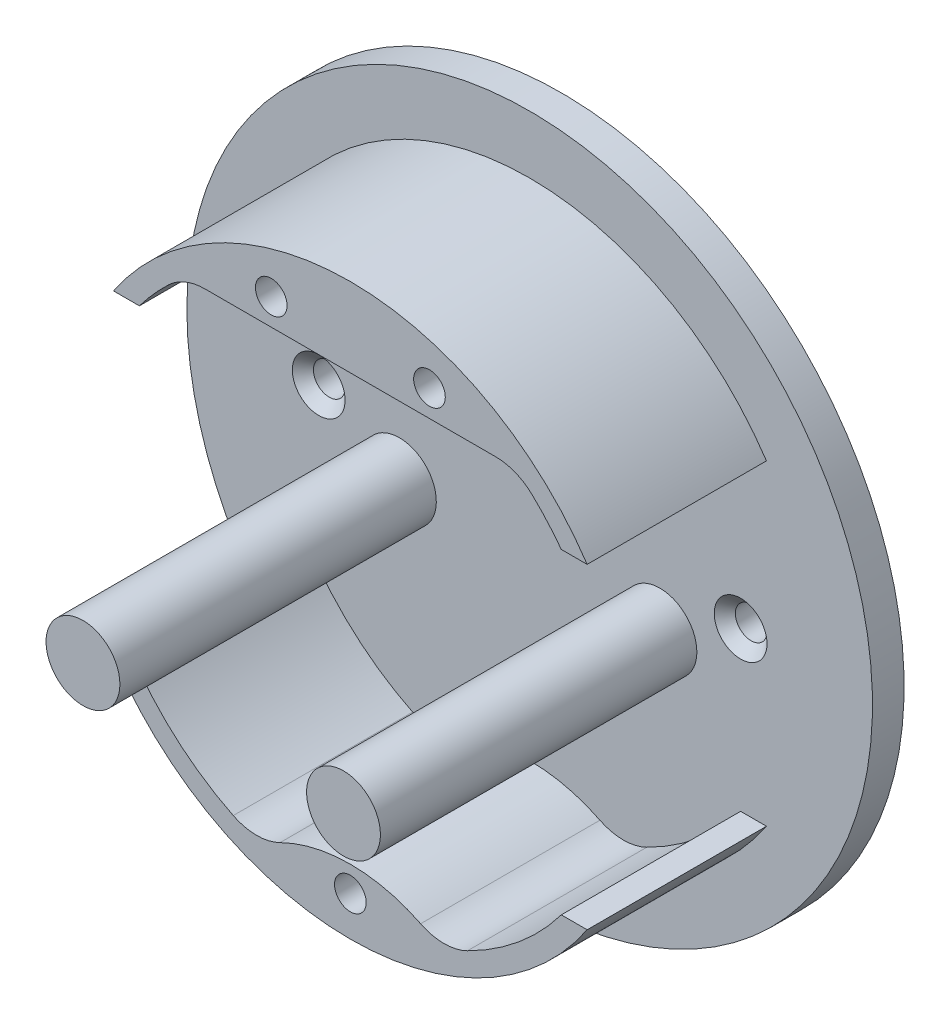
ISO-10303-21;
HEADER;
FILE_DESCRIPTION(('STEP AP214'),'2;1');
FILE_NAME('part.step','',(''),(''),'','','');
FILE_SCHEMA(('AUTOMOTIVE_DESIGN { 1 0 10303 214 1 1 1 1 }'));
ENDSEC;
DATA;
#1=APPLICATION_CONTEXT('core data for automotive mechanical design processes');
#2=APPLICATION_PROTOCOL_DEFINITION('international standard','automotive_design',2000,#1);
#3=PRODUCT_CONTEXT('',#1,'mechanical');
#4=PRODUCT('Part','Part','',(#3));
#5=PRODUCT_RELATED_PRODUCT_CATEGORY('part','',(#4));
#6=PRODUCT_DEFINITION_FORMATION('','',#4);
#7=PRODUCT_DEFINITION_CONTEXT('part definition',#1,'design');
#8=PRODUCT_DEFINITION('design','',#6,#7);
#9=PRODUCT_DEFINITION_SHAPE('','',#8);
#10=(LENGTH_UNIT() NAMED_UNIT(*) SI_UNIT(.MILLI.,.METRE.));
#11=(NAMED_UNIT(*) PLANE_ANGLE_UNIT() SI_UNIT($,.RADIAN.));
#12=(NAMED_UNIT(*) SI_UNIT($,.STERADIAN.) SOLID_ANGLE_UNIT());
#13=UNCERTAINTY_MEASURE_WITH_UNIT(LENGTH_MEASURE(1.E-05),#10,'distance_accuracy_value','');
#14=(GEOMETRIC_REPRESENTATION_CONTEXT(3) GLOBAL_UNCERTAINTY_ASSIGNED_CONTEXT((#13)) GLOBAL_UNIT_ASSIGNED_CONTEXT((#10,
#11,#12)) REPRESENTATION_CONTEXT('',''));
#15=CARTESIAN_POINT('',(0.,0.,0.));
#16=DIRECTION('',(0.,0.,1.));
#17=DIRECTION('',(1.,0.,0.));
#18=AXIS2_PLACEMENT_3D('',#15,#16,#17);
#19=CARTESIAN_POINT('',(0.,0.,20.));
#20=DIRECTION('',(0.,0.,-1.));
#21=DIRECTION('',(-1.,0.,0.));
#22=AXIS2_PLACEMENT_3D('',#19,#20,#21);
#23=CYLINDRICAL_SURFACE('',#22,25.);
#24=DIRECTION('',(0.,0.,-1.));
#25=VECTOR('',#24,1.);
#26=CARTESIAN_POINT('',(-20.,15.,20.));
#27=LINE('',#26,#25);
#28=CARTESIAN_POINT('',(-20.,15.,3.));
#29=VERTEX_POINT('',#28);
#30=CARTESIAN_POINT('',(-20.,15.,20.));
#31=VERTEX_POINT('',#30);
#32=EDGE_CURVE('E164',#29,#31,#27,.F.);
#33=ORIENTED_EDGE('',*,*,#32,.F.);
#34=CARTESIAN_POINT('',(0.,0.,3.));
#35=DIRECTION('',(0.,0.,-1.));
#36=DIRECTION('',(-1.,0.,0.));
#37=AXIS2_PLACEMENT_3D('',#34,#35,#36);
#38=CIRCLE('',#37,25.);
#39=CARTESIAN_POINT('',(-17.2187216424449,18.125,3.));
#40=VERTEX_POINT('',#39);
#41=EDGE_CURVE('E162',#29,#40,#38,.T.);
#42=ORIENTED_EDGE('',*,*,#41,.T.);
#43=DIRECTION('',(0.,0.,-1.));
#44=VECTOR('',#43,1.);
#45=CARTESIAN_POINT('',(-17.2187216424449,18.125,20.));
#46=LINE('',#45,#44);
#47=CARTESIAN_POINT('',(-17.2187216424449,18.125,20.));
#48=VERTEX_POINT('',#47);
#49=EDGE_CURVE('E147',#40,#48,#46,.F.);
#50=ORIENTED_EDGE('',*,*,#49,.T.);
#51=CARTESIAN_POINT('',(0.,0.,20.));
#52=DIRECTION('',(0.,0.,1.));
#53=DIRECTION('',(1.,0.,0.));
#54=AXIS2_PLACEMENT_3D('',#51,#52,#53);
#55=CIRCLE('',#54,25.);
#56=EDGE_CURVE('E294',#48,#31,#55,.T.);
#57=ORIENTED_EDGE('',*,*,#56,.T.);
#58=EDGE_LOOP('',(#33,#42,#50,#57));
#59=FACE_BOUND('',#58,.T.);
#60=ADVANCED_FACE('F33',(#59),#23,.F.);
#61=DIRECTION('',(0.,0.,-1.));
#62=VECTOR('',#61,1.);
#63=CARTESIAN_POINT('',(-11.1026593463273,-22.3993516745332,20.));
#64=LINE('',#63,#62);
#65=CARTESIAN_POINT('',(-11.1026593463273,-22.3993516745332,20.));
#66=VERTEX_POINT('',#65);
#67=CARTESIAN_POINT('',(-11.1026593463273,-22.3993516745332,3.));
#68=VERTEX_POINT('',#67);
#69=EDGE_CURVE('E157',#66,#68,#64,.T.);
#70=ORIENTED_EDGE('',*,*,#69,.T.);
#71=CARTESIAN_POINT('',(-20.,-15.,3.));
#72=VERTEX_POINT('',#71);
#73=EDGE_CURVE('E169',#68,#72,#38,.T.);
#74=ORIENTED_EDGE('',*,*,#73,.T.);
#75=DIRECTION('',(0.,0.,-1.));
#76=VECTOR('',#75,1.);
#77=CARTESIAN_POINT('',(-20.,-15.,20.));
#78=LINE('',#77,#76);
#79=CARTESIAN_POINT('',(-20.,-15.,20.));
#80=VERTEX_POINT('',#79);
#81=EDGE_CURVE('E305',#80,#72,#78,.T.);
#82=ORIENTED_EDGE('',*,*,#81,.F.);
#83=EDGE_CURVE('E295',#80,#66,#55,.T.);
#84=ORIENTED_EDGE('',*,*,#83,.T.);
#85=EDGE_LOOP('',(#70,#74,#82,#84));
#86=FACE_BOUND('',#85,.T.);
#87=ADVANCED_FACE('F381',(#86),#23,.F.);
#88=DIRECTION('',(0.,0.,-1.));
#89=VECTOR('',#88,1.);
#90=CARTESIAN_POINT('',(17.2187216424449,18.125,20.));
#91=LINE('',#90,#89);
#92=CARTESIAN_POINT('',(17.2187216424449,18.125,20.));
#93=VERTEX_POINT('',#92);
#94=CARTESIAN_POINT('',(17.2187216424449,18.125,3.));
#95=VERTEX_POINT('',#94);
#96=EDGE_CURVE('E313',#93,#95,#91,.T.);
#97=ORIENTED_EDGE('',*,*,#96,.T.);
#98=CARTESIAN_POINT('',(0.,0.,3.));
#99=DIRECTION('',(0.,0.,-1.));
#100=DIRECTION('',(-1.,0.,0.));
#101=AXIS2_PLACEMENT_3D('',#98,#99,#100);
#102=CIRCLE('',#101,25.);
#103=CARTESIAN_POINT('',(20.,15.,3.));
#104=VERTEX_POINT('',#103);
#105=EDGE_CURVE('E231',#95,#104,#102,.T.);
#106=ORIENTED_EDGE('',*,*,#105,.T.);
#107=DIRECTION('',(0.,0.,-1.));
#108=VECTOR('',#107,1.);
#109=CARTESIAN_POINT('',(20.,15.,20.));
#110=LINE('',#109,#108);
#111=CARTESIAN_POINT('',(20.,15.,20.));
#112=VERTEX_POINT('',#111);
#113=EDGE_CURVE('E302',#112,#104,#110,.T.);
#114=ORIENTED_EDGE('',*,*,#113,.F.);
#115=EDGE_CURVE('E290',#112,#93,#55,.T.);
#116=ORIENTED_EDGE('',*,*,#115,.T.);
#117=EDGE_LOOP('',(#97,#106,#114,#116));
#118=FACE_BOUND('',#117,.T.);
#119=ADVANCED_FACE('F338',(#118),#23,.F.);
#120=DIRECTION('',(0.,0.,-1.));
#121=VECTOR('',#120,1.);
#122=CARTESIAN_POINT('',(20.,-15.,20.));
#123=LINE('',#122,#121);
#124=CARTESIAN_POINT('',(20.,-15.,3.));
#125=VERTEX_POINT('',#124);
#126=CARTESIAN_POINT('',(20.,-15.,20.));
#127=VERTEX_POINT('',#126);
#128=EDGE_CURVE('E299',#125,#127,#123,.F.);
#129=ORIENTED_EDGE('',*,*,#128,.F.);
#130=CARTESIAN_POINT('',(11.1026593463273,-22.3993516745332,3.));
#131=VERTEX_POINT('',#130);
#132=EDGE_CURVE('E56',#125,#131,#102,.T.);
#133=ORIENTED_EDGE('',*,*,#132,.T.);
#134=DIRECTION('',(0.,0.,-1.));
#135=VECTOR('',#134,1.);
#136=CARTESIAN_POINT('',(11.1026593463273,-22.3993516745332,20.));
#137=LINE('',#136,#135);
#138=CARTESIAN_POINT('',(11.1026593463273,-22.3993516745332,20.));
#139=VERTEX_POINT('',#138);
#140=EDGE_CURVE('E158',#131,#139,#137,.F.);
#141=ORIENTED_EDGE('',*,*,#140,.T.);
#142=EDGE_CURVE('E289',#139,#127,#55,.T.);
#143=ORIENTED_EDGE('',*,*,#142,.T.);
#144=EDGE_LOOP('',(#129,#133,#141,#143));
#145=FACE_BOUND('',#144,.T.);
#146=ADVANCED_FACE('F354',(#145),#23,.F.);
#147=CARTESIAN_POINT('',(0.,0.,20.));
#148=DIRECTION('',(0.,0.,-1.));
#149=DIRECTION('',(-1.,0.,0.));
#150=AXIS2_PLACEMENT_3D('',#147,#148,#149);
#151=CYLINDRICAL_SURFACE('',#150,27.);
#152=CARTESIAN_POINT('',(0.,0.,3.));
#153=DIRECTION('',(0.,0.,-1.));
#154=DIRECTION('',(-1.,0.,0.));
#155=AXIS2_PLACEMENT_3D('',#152,#153,#154);
#156=CIRCLE('',#155,27.);
#157=CARTESIAN_POINT('',(-22.4499443206436,15.,3.));
#158=VERTEX_POINT('',#157);
#159=CARTESIAN_POINT('',(22.4499443206436,15.,3.));
#160=VERTEX_POINT('',#159);
#161=EDGE_CURVE('E228',#158,#160,#156,.T.);
#162=ORIENTED_EDGE('',*,*,#161,.F.);
#163=DIRECTION('',(0.,0.,-1.));
#164=VECTOR('',#163,1.);
#165=CARTESIAN_POINT('',(-22.4499443206436,15.,20.));
#166=LINE('',#165,#164);
#167=CARTESIAN_POINT('',(-22.4499443206436,15.,20.));
#168=VERTEX_POINT('',#167);
#169=EDGE_CURVE('E282',#158,#168,#166,.F.);
#170=ORIENTED_EDGE('',*,*,#169,.T.);
#171=CARTESIAN_POINT('',(0.,0.,20.));
#172=DIRECTION('',(0.,0.,1.));
#173=DIRECTION('',(1.,0.,0.));
#174=AXIS2_PLACEMENT_3D('',#171,#172,#173);
#175=CIRCLE('',#174,27.);
#176=CARTESIAN_POINT('',(22.4499443206436,15.,20.));
#177=VERTEX_POINT('',#176);
#178=EDGE_CURVE('E298',#177,#168,#175,.T.);
#179=ORIENTED_EDGE('',*,*,#178,.F.);
#180=DIRECTION('',(0.,0.,-1.));
#181=VECTOR('',#180,1.);
#182=CARTESIAN_POINT('',(22.4499443206436,15.,20.));
#183=LINE('',#182,#181);
#184=EDGE_CURVE('E286',#177,#160,#183,.T.);
#185=ORIENTED_EDGE('',*,*,#184,.T.);
#186=EDGE_LOOP('',(#162,#170,#179,#185));
#187=FACE_BOUND('',#186,.T.);
#188=ADVANCED_FACE('F348',(#187),#151,.T.);
#189=CARTESIAN_POINT('',(22.4499443206436,-15.,3.));
#190=VERTEX_POINT('',#189);
#191=CARTESIAN_POINT('',(-22.4499443206436,-15.,3.));
#192=VERTEX_POINT('',#191);
#193=EDGE_CURVE('E227',#190,#192,#156,.T.);
#194=ORIENTED_EDGE('',*,*,#193,.F.);
#195=DIRECTION('',(0.,0.,-1.));
#196=VECTOR('',#195,1.);
#197=CARTESIAN_POINT('',(22.4499443206436,-15.,20.));
#198=LINE('',#197,#196);
#199=CARTESIAN_POINT('',(22.4499443206436,-15.,20.));
#200=VERTEX_POINT('',#199);
#201=EDGE_CURVE('E273',#190,#200,#198,.F.);
#202=ORIENTED_EDGE('',*,*,#201,.T.);
#203=CARTESIAN_POINT('',(-22.4499443206436,-15.,20.));
#204=VERTEX_POINT('',#203);
#205=EDGE_CURVE('E293',#204,#200,#175,.T.);
#206=ORIENTED_EDGE('',*,*,#205,.F.);
#207=DIRECTION('',(0.,0.,-1.));
#208=VECTOR('',#207,1.);
#209=CARTESIAN_POINT('',(-22.4499443206436,-15.,20.));
#210=LINE('',#209,#208);
#211=EDGE_CURVE('E277',#204,#192,#210,.T.);
#212=ORIENTED_EDGE('',*,*,#211,.T.);
#213=EDGE_LOOP('',(#194,#202,#206,#212));
#214=FACE_BOUND('',#213,.T.);
#215=ADVANCED_FACE('F366',(#214),#151,.T.);
#216=CARTESIAN_POINT('',(-15.644487847162,19.5,20.));
#217=DIRECTION('',(0.,1.,0.));
#218=DIRECTION('',(0.,0.,1.));
#219=AXIS2_PLACEMENT_3D('',#216,#217,#218);
#220=PLANE('',#219);
#221=DIRECTION('',(-1.,0.,0.));
#222=VECTOR('',#221,1.);
#223=CARTESIAN_POINT('',(-15.644487847162,19.5,3.));
#224=LINE('',#223,#222);
#225=CARTESIAN_POINT('',(13.7749773139559,19.5,3.));
#226=VERTEX_POINT('',#225);
#227=CARTESIAN_POINT('',(-13.7749773139559,19.5,3.));
#228=VERTEX_POINT('',#227);
#229=EDGE_CURVE('E167',#226,#228,#224,.T.);
#230=ORIENTED_EDGE('',*,*,#229,.F.);
#231=DIRECTION('',(0.,0.,-1.));
#232=VECTOR('',#231,1.);
#233=CARTESIAN_POINT('',(13.7749773139559,19.5,20.));
#234=LINE('',#233,#232);
#235=CARTESIAN_POINT('',(13.7749773139559,19.5,20.));
#236=VERTEX_POINT('',#235);
#237=EDGE_CURVE('E321',#226,#236,#234,.F.);
#238=ORIENTED_EDGE('',*,*,#237,.T.);
#239=DIRECTION('',(1.,0.,0.));
#240=VECTOR('',#239,1.);
#241=CARTESIAN_POINT('',(-15.644487847162,19.5,20.));
#242=LINE('',#241,#240);
#243=CARTESIAN_POINT('',(-13.7749773139559,19.5,20.));
#244=VERTEX_POINT('',#243);
#245=EDGE_CURVE('E261',#244,#236,#242,.T.);
#246=ORIENTED_EDGE('',*,*,#245,.F.);
#247=DIRECTION('',(0.,0.,-1.));
#248=VECTOR('',#247,1.);
#249=CARTESIAN_POINT('',(-13.7749773139559,19.5,20.));
#250=LINE('',#249,#248);
#251=EDGE_CURVE('E319',#244,#228,#250,.T.);
#252=ORIENTED_EDGE('',*,*,#251,.T.);
#253=EDGE_LOOP('',(#230,#238,#246,#252));
#254=FACE_BOUND('',#253,.T.);
#255=ADVANCED_FACE('F495',(#254),#220,.F.);
#256=CARTESIAN_POINT('',(-7.5,22.0071011266818,20.));
#257=DIRECTION('',(0.,0.,-1.));
#258=DIRECTION('',(-1.,0.,0.));
#259=AXIS2_PLACEMENT_3D('',#256,#257,#258);
#260=CYLINDRICAL_SURFACE('',#259,1.5);
#261=CARTESIAN_POINT('',(-7.5,22.0071011266818,20.));
#262=DIRECTION('',(0.,0.,1.));
#263=DIRECTION('',(1.,0.,0.));
#264=AXIS2_PLACEMENT_3D('',#261,#262,#263);
#265=CIRCLE('',#264,1.5);
#266=CARTESIAN_POINT('',(-6.,22.0071011266818,20.));
#267=VERTEX_POINT('',#266);
#268=EDGE_CURVE('E258',#267,#267,#265,.T.);
#269=ORIENTED_EDGE('',*,*,#268,.T.);
#270=EDGE_LOOP('',(#269));
#271=FACE_BOUND('',#270,.T.);
#272=CARTESIAN_POINT('',(-7.5,22.0071011266818,3.));
#273=DIRECTION('',(0.,0.,-1.));
#274=DIRECTION('',(-1.,0.,0.));
#275=AXIS2_PLACEMENT_3D('',#272,#273,#274);
#276=CIRCLE('',#275,1.5);
#277=CARTESIAN_POINT('',(-9.,22.0071011266818,3.));
#278=VERTEX_POINT('',#277);
#279=EDGE_CURVE('E246',#278,#278,#276,.T.);
#280=ORIENTED_EDGE('',*,*,#279,.T.);
#281=EDGE_LOOP('',(#280));
#282=FACE_BOUND('',#281,.T.);
#283=ADVANCED_FACE('F487',(#271,#282),#260,.F.);
#284=CARTESIAN_POINT('',(7.5,22.0071011266818,20.));
#285=DIRECTION('',(0.,0.,-1.));
#286=DIRECTION('',(-1.,0.,0.));
#287=AXIS2_PLACEMENT_3D('',#284,#285,#286);
#288=CYLINDRICAL_SURFACE('',#287,1.5);
#289=CARTESIAN_POINT('',(7.5,22.0071011266818,20.));
#290=DIRECTION('',(0.,0.,1.));
#291=DIRECTION('',(1.,0.,0.));
#292=AXIS2_PLACEMENT_3D('',#289,#290,#291);
#293=CIRCLE('',#292,1.5);
#294=CARTESIAN_POINT('',(9.,22.0071011266818,20.));
#295=VERTEX_POINT('',#294);
#296=EDGE_CURVE('E255',#295,#295,#293,.T.);
#297=ORIENTED_EDGE('',*,*,#296,.T.);
#298=EDGE_LOOP('',(#297));
#299=FACE_BOUND('',#298,.T.);
#300=CARTESIAN_POINT('',(7.5,22.0071011266818,3.));
#301=DIRECTION('',(0.,0.,-1.));
#302=DIRECTION('',(-1.,0.,0.));
#303=AXIS2_PLACEMENT_3D('',#300,#301,#302);
#304=CIRCLE('',#303,1.5);
#305=CARTESIAN_POINT('',(6.,22.0071011266818,3.));
#306=VERTEX_POINT('',#305);
#307=EDGE_CURVE('E243',#306,#306,#304,.T.);
#308=ORIENTED_EDGE('',*,*,#307,.T.);
#309=EDGE_LOOP('',(#308));
#310=FACE_BOUND('',#309,.T.);
#311=ADVANCED_FACE('F480',(#299,#310),#288,.F.);
#312=CARTESIAN_POINT('',(0.,-35.8389626792531,20.));
#313=DIRECTION('',(0.,0.,-1.));
#314=DIRECTION('',(-1.,0.,0.));
#315=AXIS2_PLACEMENT_3D('',#312,#313,#314);
#316=CYLINDRICAL_SURFACE('',#315,15.);
#317=CARTESIAN_POINT('',(0.,-35.8389626792531,3.));
#318=DIRECTION('',(0.,0.,-1.));
#319=DIRECTION('',(-1.,0.,0.));
#320=AXIS2_PLACEMENT_3D('',#317,#318,#319);
#321=CIRCLE('',#320,15.);
#322=CARTESIAN_POINT('',(-6.66159560779636,-22.3993516745332,3.));
#323=VERTEX_POINT('',#322);
#324=CARTESIAN_POINT('',(6.66159560779637,-22.3993516745332,3.));
#325=VERTEX_POINT('',#324);
#326=EDGE_CURVE('E236',#323,#325,#321,.T.);
#327=ORIENTED_EDGE('',*,*,#326,.F.);
#328=DIRECTION('',(0.,0.,-1.));
#329=VECTOR('',#328,1.);
#330=CARTESIAN_POINT('',(-6.66159560779636,-22.3993516745332,20.));
#331=LINE('',#330,#329);
#332=CARTESIAN_POINT('',(-6.66159560779636,-22.3993516745332,20.));
#333=VERTEX_POINT('',#332);
#334=EDGE_CURVE('E309',#323,#333,#331,.F.);
#335=ORIENTED_EDGE('',*,*,#334,.T.);
#336=CARTESIAN_POINT('',(0.,-35.8389626792531,20.));
#337=DIRECTION('',(0.,0.,1.));
#338=DIRECTION('',(1.,0.,0.));
#339=AXIS2_PLACEMENT_3D('',#336,#337,#338);
#340=CIRCLE('',#339,15.);
#341=CARTESIAN_POINT('',(6.66159560779637,-22.3993516745332,20.));
#342=VERTEX_POINT('',#341);
#343=EDGE_CURVE('E252',#342,#333,#340,.T.);
#344=ORIENTED_EDGE('',*,*,#343,.F.);
#345=DIRECTION('',(0.,0.,-1.));
#346=VECTOR('',#345,1.);
#347=CARTESIAN_POINT('',(6.66159560779637,-22.3993516745332,20.));
#348=LINE('',#347,#346);
#349=EDGE_CURVE('E311',#342,#325,#348,.T.);
#350=ORIENTED_EDGE('',*,*,#349,.T.);
#351=EDGE_LOOP('',(#327,#335,#344,#350));
#352=FACE_BOUND('',#351,.T.);
#353=ADVANCED_FACE('F373',(#352),#316,.T.);
#354=CARTESIAN_POINT('',(0.,-23.25,20.));
#355=DIRECTION('',(0.,0.,-1.));
#356=DIRECTION('',(-1.,0.,0.));
#357=AXIS2_PLACEMENT_3D('',#354,#355,#356);
#358=CYLINDRICAL_SURFACE('',#357,1.5);
#359=CARTESIAN_POINT('',(0.,-23.25,20.));
#360=DIRECTION('',(0.,0.,1.));
#361=DIRECTION('',(1.,0.,0.));
#362=AXIS2_PLACEMENT_3D('',#359,#360,#361);
#363=CIRCLE('',#362,1.5);
#364=CARTESIAN_POINT('',(1.5,-23.25,20.));
#365=VERTEX_POINT('',#364);
#366=EDGE_CURVE('E249',#365,#365,#363,.T.);
#367=ORIENTED_EDGE('',*,*,#366,.T.);
#368=EDGE_LOOP('',(#367));
#369=FACE_BOUND('',#368,.T.);
#370=CARTESIAN_POINT('',(0.,-23.25,3.));
#371=DIRECTION('',(0.,0.,-1.));
#372=DIRECTION('',(-1.,0.,0.));
#373=AXIS2_PLACEMENT_3D('',#370,#371,#372);
#374=CIRCLE('',#373,1.5);
#375=CARTESIAN_POINT('',(-1.5,-23.25,3.));
#376=VERTEX_POINT('',#375);
#377=EDGE_CURVE('E240',#376,#376,#374,.T.);
#378=ORIENTED_EDGE('',*,*,#377,.T.);
#379=EDGE_LOOP('',(#378));
#380=FACE_BOUND('',#379,.T.);
#381=ADVANCED_FACE('F466',(#369,#380),#358,.F.);
#382=CARTESIAN_POINT('',(8.88212747706182,-17.9194813396265,20.));
#383=DIRECTION('',(0.,0.,-1.));
#384=DIRECTION('',(-1.,0.,0.));
#385=AXIS2_PLACEMENT_3D('',#382,#383,#384);
#386=CYLINDRICAL_SURFACE('',#385,5.);
#387=CARTESIAN_POINT('',(8.88212747706182,-17.9194813396265,3.));
#388=DIRECTION('',(0.,0.,-1.));
#389=DIRECTION('',(-1.,0.,0.));
#390=AXIS2_PLACEMENT_3D('',#387,#388,#389);
#391=CIRCLE('',#390,5.);
#392=EDGE_CURVE('E48',#325,#131,#391,.F.);
#393=ORIENTED_EDGE('',*,*,#392,.F.);
#394=ORIENTED_EDGE('',*,*,#349,.F.);
#395=CARTESIAN_POINT('',(8.88212747706182,-17.9194813396265,20.));
#396=DIRECTION('',(0.,0.,1.));
#397=DIRECTION('',(1.,0.,0.));
#398=AXIS2_PLACEMENT_3D('',#395,#396,#397);
#399=CIRCLE('',#398,5.);
#400=EDGE_CURVE('E323',#139,#342,#399,.F.);
#401=ORIENTED_EDGE('',*,*,#400,.F.);
#402=ORIENTED_EDGE('',*,*,#140,.F.);
#403=EDGE_LOOP('',(#393,#394,#401,#402));
#404=FACE_BOUND('',#403,.T.);
#405=ADVANCED_FACE('F459',(#404),#386,.F.);
#406=CARTESIAN_POINT('',(-8.88212747706181,-17.9194813396265,20.));
#407=DIRECTION('',(0.,0.,-1.));
#408=DIRECTION('',(-1.,0.,0.));
#409=AXIS2_PLACEMENT_3D('',#406,#407,#408);
#410=CYLINDRICAL_SURFACE('',#409,5.);
#411=CARTESIAN_POINT('',(-8.88212747706181,-17.9194813396265,3.));
#412=DIRECTION('',(0.,0.,-1.));
#413=DIRECTION('',(-1.,0.,0.));
#414=AXIS2_PLACEMENT_3D('',#411,#412,#413);
#415=CIRCLE('',#414,5.);
#416=EDGE_CURVE('E233',#68,#323,#415,.F.);
#417=ORIENTED_EDGE('',*,*,#416,.F.);
#418=ORIENTED_EDGE('',*,*,#69,.F.);
#419=CARTESIAN_POINT('',(-8.88212747706181,-17.9194813396265,20.));
#420=DIRECTION('',(0.,0.,1.));
#421=DIRECTION('',(1.,0.,0.));
#422=AXIS2_PLACEMENT_3D('',#419,#420,#421);
#423=CIRCLE('',#422,5.);
#424=EDGE_CURVE('E325',#333,#66,#423,.F.);
#425=ORIENTED_EDGE('',*,*,#424,.F.);
#426=ORIENTED_EDGE('',*,*,#334,.F.);
#427=EDGE_LOOP('',(#417,#418,#425,#426));
#428=FACE_BOUND('',#427,.T.);
#429=ADVANCED_FACE('F377',(#428),#410,.F.);
#430=CARTESIAN_POINT('',(13.7749773139559,14.5,20.));
#431=DIRECTION('',(0.,0.,-1.));
#432=DIRECTION('',(-1.,0.,0.));
#433=AXIS2_PLACEMENT_3D('',#430,#431,#432);
#434=CYLINDRICAL_SURFACE('',#433,5.);
#435=CARTESIAN_POINT('',(13.7749773139559,14.5,3.));
#436=DIRECTION('',(0.,0.,-1.));
#437=DIRECTION('',(-1.,0.,0.));
#438=AXIS2_PLACEMENT_3D('',#435,#436,#437);
#439=CIRCLE('',#438,5.);
#440=EDGE_CURVE('E166',#95,#226,#439,.F.);
#441=ORIENTED_EDGE('',*,*,#440,.F.);
#442=ORIENTED_EDGE('',*,*,#96,.F.);
#443=CARTESIAN_POINT('',(13.7749773139559,14.5,20.));
#444=DIRECTION('',(0.,0.,1.));
#445=DIRECTION('',(1.,0.,0.));
#446=AXIS2_PLACEMENT_3D('',#443,#444,#445);
#447=CIRCLE('',#446,5.);
#448=EDGE_CURVE('E179',#236,#93,#447,.F.);
#449=ORIENTED_EDGE('',*,*,#448,.F.);
#450=ORIENTED_EDGE('',*,*,#237,.F.);
#451=EDGE_LOOP('',(#441,#442,#449,#450));
#452=FACE_BOUND('',#451,.T.);
#453=ADVANCED_FACE('F340',(#452),#434,.F.);
#454=CARTESIAN_POINT('',(-13.7749773139559,14.5,20.));
#455=DIRECTION('',(0.,0.,-1.));
#456=DIRECTION('',(-1.,0.,0.));
#457=AXIS2_PLACEMENT_3D('',#454,#455,#456);
#458=CYLINDRICAL_SURFACE('',#457,5.);
#459=CARTESIAN_POINT('',(-13.7749773139559,14.5,3.));
#460=DIRECTION('',(0.,0.,-1.));
#461=DIRECTION('',(-1.,0.,0.));
#462=AXIS2_PLACEMENT_3D('',#459,#460,#461);
#463=CIRCLE('',#462,5.);
#464=EDGE_CURVE('E152',#228,#40,#463,.F.);
#465=ORIENTED_EDGE('',*,*,#464,.F.);
#466=ORIENTED_EDGE('',*,*,#251,.F.);
#467=CARTESIAN_POINT('',(-13.7749773139559,14.5,20.));
#468=DIRECTION('',(0.,0.,1.));
#469=DIRECTION('',(1.,0.,0.));
#470=AXIS2_PLACEMENT_3D('',#467,#468,#469);
#471=CIRCLE('',#470,5.);
#472=EDGE_CURVE('E154',#48,#244,#471,.F.);
#473=ORIENTED_EDGE('',*,*,#472,.F.);
#474=ORIENTED_EDGE('',*,*,#49,.F.);
#475=EDGE_LOOP('',(#465,#466,#473,#474));
#476=FACE_BOUND('',#475,.T.);
#477=ADVANCED_FACE('F149',(#476),#458,.F.);
#478=CARTESIAN_POINT('',(0.,0.,20.));
#479=DIRECTION('',(0.,0.,1.));
#480=DIRECTION('',(1.,0.,0.));
#481=AXIS2_PLACEMENT_3D('',#478,#479,#480);
#482=PLANE('',#481);
#483=ORIENTED_EDGE('',*,*,#56,.F.);
#484=ORIENTED_EDGE('',*,*,#472,.T.);
#485=ORIENTED_EDGE('',*,*,#245,.T.);
#486=ORIENTED_EDGE('',*,*,#448,.T.);
#487=ORIENTED_EDGE('',*,*,#115,.F.);
#488=DIRECTION('',(-1.,0.,0.));
#489=VECTOR('',#488,1.);
#490=CARTESIAN_POINT('',(0.,15.,20.));
#491=LINE('',#490,#489);
#492=EDGE_CURVE('E283',#177,#112,#491,.T.);
#493=ORIENTED_EDGE('',*,*,#492,.F.);
#494=ORIENTED_EDGE('',*,*,#178,.T.);
#495=EDGE_CURVE('E280',#31,#168,#491,.T.);
#496=ORIENTED_EDGE('',*,*,#495,.F.);
#497=EDGE_LOOP('',(#483,#484,#485,#486,#487,#493,#494,#496));
#498=FACE_BOUND('',#497,.T.);
#499=ORIENTED_EDGE('',*,*,#296,.F.);
#500=EDGE_LOOP('',(#499));
#501=FACE_BOUND('',#500,.T.);
#502=ORIENTED_EDGE('',*,*,#268,.F.);
#503=EDGE_LOOP('',(#502));
#504=FACE_BOUND('',#503,.T.);
#505=ADVANCED_FACE('F329',(#498,#501,#504),#482,.T.);
#506=ORIENTED_EDGE('',*,*,#142,.F.);
#507=ORIENTED_EDGE('',*,*,#400,.T.);
#508=ORIENTED_EDGE('',*,*,#343,.T.);
#509=ORIENTED_EDGE('',*,*,#424,.T.);
#510=ORIENTED_EDGE('',*,*,#83,.F.);
#511=DIRECTION('',(1.,0.,0.));
#512=VECTOR('',#511,1.);
#513=CARTESIAN_POINT('',(0.,-15.,20.));
#514=LINE('',#513,#512);
#515=EDGE_CURVE('E274',#204,#80,#514,.T.);
#516=ORIENTED_EDGE('',*,*,#515,.F.);
#517=ORIENTED_EDGE('',*,*,#205,.T.);
#518=EDGE_CURVE('E271',#127,#200,#514,.T.);
#519=ORIENTED_EDGE('',*,*,#518,.F.);
#520=EDGE_LOOP('',(#506,#507,#508,#509,#510,#516,#517,#519));
#521=FACE_BOUND('',#520,.T.);
#522=ORIENTED_EDGE('',*,*,#366,.F.);
#523=EDGE_LOOP('',(#522));
#524=FACE_BOUND('',#523,.T.);
#525=ADVANCED_FACE('F360',(#521,#524),#482,.T.);
#526=CARTESIAN_POINT('',(-27.,-15.,24.3948870619725));
#527=DIRECTION('',(0.,-1.,0.));
#528=DIRECTION('',(0.,0.,-1.));
#529=AXIS2_PLACEMENT_3D('',#526,#527,#528);
#530=PLANE('',#529);
#531=DIRECTION('',(1.,0.,0.));
#532=VECTOR('',#531,1.);
#533=CARTESIAN_POINT('',(-27.,-15.,3.));
#534=LINE('',#533,#532);
#535=EDGE_CURVE('E264',#125,#190,#534,.T.);
#536=ORIENTED_EDGE('',*,*,#535,.F.);
#537=ORIENTED_EDGE('',*,*,#128,.T.);
#538=ORIENTED_EDGE('',*,*,#518,.T.);
#539=ORIENTED_EDGE('',*,*,#201,.F.);
#540=EDGE_LOOP('',(#536,#537,#538,#539));
#541=FACE_BOUND('',#540,.T.);
#542=ADVANCED_FACE('F198',(#541),#530,.F.);
#543=CARTESIAN_POINT('',(-27.,15.,3.));
#544=DIRECTION('',(0.,0.,-1.));
#545=DIRECTION('',(0.,1.,0.));
#546=AXIS2_PLACEMENT_3D('',#543,#544,#545);
#547=PLANE('',#546);
#548=CARTESIAN_POINT('',(12.35,-4.,3.));
#549=DIRECTION('',(0.,0.,-1.));
#550=DIRECTION('',(0.,1.,0.));
#551=AXIS2_PLACEMENT_3D('',#548,#549,#550);
#552=CIRCLE('',#551,3.5);
#553=CARTESIAN_POINT('',(12.35,-0.5,3.));
#554=VERTEX_POINT('',#553);
#555=EDGE_CURVE('E11',#554,#554,#552,.F.);
#556=ORIENTED_EDGE('',*,*,#555,.F.);
#557=EDGE_LOOP('',(#556));
#558=FACE_BOUND('',#557,.T.);
#559=CARTESIAN_POINT('',(-12.35,-4.,3.));
#560=DIRECTION('',(0.,0.,-1.));
#561=DIRECTION('',(0.,1.,0.));
#562=AXIS2_PLACEMENT_3D('',#559,#560,#561);
#563=CIRCLE('',#562,3.5);
#564=CARTESIAN_POINT('',(-12.35,-0.5,3.));
#565=VERTEX_POINT('',#564);
#566=EDGE_CURVE('E41',#565,#565,#563,.F.);
#567=ORIENTED_EDGE('',*,*,#566,.F.);
#568=EDGE_LOOP('',(#567));
#569=FACE_BOUND('',#568,.T.);
#570=CARTESIAN_POINT('',(20.,0.,3.));
#571=DIRECTION('',(0.,0.,-1.));
#572=DIRECTION('',(0.,1.,0.));
#573=AXIS2_PLACEMENT_3D('',#570,#571,#572);
#574=CIRCLE('',#573,2.49999999999998);
#575=CARTESIAN_POINT('',(20.,2.49999999999998,3.));
#576=VERTEX_POINT('',#575);
#577=EDGE_CURVE('E185',#576,#576,#574,.T.);
#578=ORIENTED_EDGE('',*,*,#577,.T.);
#579=EDGE_LOOP('',(#578));
#580=FACE_BOUND('',#579,.T.);
#581=CARTESIAN_POINT('',(-20.,0.,3.));
#582=DIRECTION('',(0.,0.,-1.));
#583=DIRECTION('',(0.,1.,0.));
#584=AXIS2_PLACEMENT_3D('',#581,#582,#583);
#585=CIRCLE('',#584,2.49999999999998);
#586=CARTESIAN_POINT('',(-20.,2.49999999999998,3.));
#587=VERTEX_POINT('',#586);
#588=EDGE_CURVE('E177',#587,#587,#585,.T.);
#589=ORIENTED_EDGE('',*,*,#588,.T.);
#590=EDGE_LOOP('',(#589));
#591=FACE_BOUND('',#590,.T.);
#592=CARTESIAN_POINT('',(0.,15.,3.));
#593=DIRECTION('',(0.,0.,1.));
#594=DIRECTION('',(1.,0.,0.));
#595=AXIS2_PLACEMENT_3D('',#592,#593,#594);
#596=CIRCLE('',#595,4.);
#597=CARTESIAN_POINT('',(4.,15.,3.));
#598=VERTEX_POINT('',#597);
#599=EDGE_CURVE('E207',#598,#598,#596,.T.);
#600=ORIENTED_EDGE('',*,*,#599,.F.);
#601=EDGE_LOOP('',(#600));
#602=FACE_BOUND('',#601,.T.);
#603=ORIENTED_EDGE('',*,*,#41,.F.);
#604=DIRECTION('',(1.,0.,0.));
#605=VECTOR('',#604,1.);
#606=CARTESIAN_POINT('',(-27.,15.,3.));
#607=LINE('',#606,#605);
#608=EDGE_CURVE('E267',#158,#29,#607,.T.);
#609=ORIENTED_EDGE('',*,*,#608,.F.);
#610=ORIENTED_EDGE('',*,*,#161,.T.);
#611=EDGE_CURVE('E265',#104,#160,#607,.T.);
#612=ORIENTED_EDGE('',*,*,#611,.F.);
#613=ORIENTED_EDGE('',*,*,#105,.F.);
#614=ORIENTED_EDGE('',*,*,#440,.T.);
#615=ORIENTED_EDGE('',*,*,#229,.T.);
#616=ORIENTED_EDGE('',*,*,#464,.T.);
#617=EDGE_LOOP('',(#603,#609,#610,#612,#613,#614,#615,#616));
#618=FACE_BOUND('',#617,.T.);
#619=EDGE_CURVE('E268',#192,#72,#534,.T.);
#620=ORIENTED_EDGE('',*,*,#619,.T.);
#621=ORIENTED_EDGE('',*,*,#73,.F.);
#622=ORIENTED_EDGE('',*,*,#416,.T.);
#623=ORIENTED_EDGE('',*,*,#326,.T.);
#624=ORIENTED_EDGE('',*,*,#392,.T.);
#625=ORIENTED_EDGE('',*,*,#132,.F.);
#626=ORIENTED_EDGE('',*,*,#535,.T.);
#627=ORIENTED_EDGE('',*,*,#193,.T.);
#628=EDGE_LOOP('',(#620,#621,#622,#623,#624,#625,#626,#627));
#629=FACE_BOUND('',#628,.T.);
#630=CARTESIAN_POINT('',(0.,0.,3.));
#631=DIRECTION('',(0.,0.,-1.));
#632=DIRECTION('',(-1.,0.,0.));
#633=AXIS2_PLACEMENT_3D('',#630,#631,#632);
#634=CIRCLE('',#633,32.5);
#635=CARTESIAN_POINT('',(-32.5,0.,3.));
#636=VERTEX_POINT('',#635);
#637=EDGE_CURVE('E220',#636,#636,#634,.T.);
#638=ORIENTED_EDGE('',*,*,#637,.F.);
#639=EDGE_LOOP('',(#638));
#640=FACE_BOUND('',#639,.T.);
#641=ADVANCED_FACE('F171',(#558,#569,#580,#591,#602,#618,#629,#640),#547,.F.);
#642=CARTESIAN_POINT('',(-27.,15.,24.3948870619725));
#643=DIRECTION('',(0.,1.,0.));
#644=DIRECTION('',(0.,0.,1.));
#645=AXIS2_PLACEMENT_3D('',#642,#643,#644);
#646=PLANE('',#645);
#647=ORIENTED_EDGE('',*,*,#492,.T.);
#648=ORIENTED_EDGE('',*,*,#113,.T.);
#649=ORIENTED_EDGE('',*,*,#611,.T.);
#650=ORIENTED_EDGE('',*,*,#184,.F.);
#651=EDGE_LOOP('',(#647,#648,#649,#650));
#652=FACE_BOUND('',#651,.T.);
#653=ADVANCED_FACE('F197',(#652),#646,.F.);
#654=ORIENTED_EDGE('',*,*,#608,.T.);
#655=ORIENTED_EDGE('',*,*,#32,.T.);
#656=ORIENTED_EDGE('',*,*,#495,.T.);
#657=ORIENTED_EDGE('',*,*,#169,.F.);
#658=EDGE_LOOP('',(#654,#655,#656,#657));
#659=FACE_BOUND('',#658,.T.);
#660=ADVANCED_FACE('F351',(#659),#646,.F.);
#661=ORIENTED_EDGE('',*,*,#515,.T.);
#662=ORIENTED_EDGE('',*,*,#81,.T.);
#663=ORIENTED_EDGE('',*,*,#619,.F.);
#664=ORIENTED_EDGE('',*,*,#211,.F.);
#665=EDGE_LOOP('',(#661,#662,#663,#664));
#666=FACE_BOUND('',#665,.T.);
#667=ADVANCED_FACE('F383',(#666),#530,.F.);
#668=CARTESIAN_POINT('',(0.,0.,3.));
#669=DIRECTION('',(0.,0.,-1.));
#670=DIRECTION('',(-1.,0.,0.));
#671=AXIS2_PLACEMENT_3D('',#668,#669,#670);
#672=PLANE('',#671);
#673=ORIENTED_EDGE('',*,*,#377,.F.);
#674=EDGE_LOOP('',(#673));
#675=FACE_BOUND('',#674,.T.);
#676=ADVANCED_FACE('F385',(#675),#672,.F.);
#677=ORIENTED_EDGE('',*,*,#307,.F.);
#678=EDGE_LOOP('',(#677));
#679=FACE_BOUND('',#678,.T.);
#680=ADVANCED_FACE('F391',(#679),#672,.F.);
#681=ORIENTED_EDGE('',*,*,#279,.F.);
#682=EDGE_LOOP('',(#681));
#683=FACE_BOUND('',#682,.T.);
#684=ADVANCED_FACE('F394',(#683),#672,.F.);
#685=CARTESIAN_POINT('',(0.,0.,3.));
#686=DIRECTION('',(0.,0.,-1.));
#687=DIRECTION('',(-1.,0.,0.));
#688=AXIS2_PLACEMENT_3D('',#685,#686,#687);
#689=CYLINDRICAL_SURFACE('',#688,32.5);
#690=ORIENTED_EDGE('',*,*,#637,.T.);
#691=EDGE_LOOP('',(#690));
#692=FACE_BOUND('',#691,.T.);
#693=CARTESIAN_POINT('',(0.,0.,0.));
#694=DIRECTION('',(0.,0.,-1.));
#695=DIRECTION('',(-1.,0.,0.));
#696=AXIS2_PLACEMENT_3D('',#693,#694,#695);
#697=CIRCLE('',#696,32.5);
#698=CARTESIAN_POINT('',(-32.5,0.,0.));
#699=VERTEX_POINT('',#698);
#700=EDGE_CURVE('E213',#699,#699,#697,.T.);
#701=ORIENTED_EDGE('',*,*,#700,.F.);
#702=EDGE_LOOP('',(#701));
#703=FACE_BOUND('',#702,.T.);
#704=ADVANCED_FACE('F550',(#692,#703),#689,.T.);
#705=CARTESIAN_POINT('',(0.,0.,0.));
#706=DIRECTION('',(0.,0.,1.));
#707=DIRECTION('',(1.,0.,0.));
#708=AXIS2_PLACEMENT_3D('',#705,#706,#707);
#709=PLANE('',#708);
#710=CARTESIAN_POINT('',(-20.,0.,0.));
#711=DIRECTION('',(0.,0.,1.));
#712=DIRECTION('',(1.,0.,0.));
#713=AXIS2_PLACEMENT_3D('',#710,#711,#712);
#714=CIRCLE('',#713,1.5);
#715=CARTESIAN_POINT('',(-18.5,0.,0.));
#716=VERTEX_POINT('',#715);
#717=EDGE_CURVE('E210',#716,#716,#714,.T.);
#718=ORIENTED_EDGE('',*,*,#717,.T.);
#719=EDGE_LOOP('',(#718));
#720=FACE_BOUND('',#719,.T.);
#721=CARTESIAN_POINT('',(20.,0.,0.));
#722=DIRECTION('',(0.,0.,1.));
#723=DIRECTION('',(1.,0.,0.));
#724=AXIS2_PLACEMENT_3D('',#721,#722,#723);
#725=CIRCLE('',#724,1.5);
#726=CARTESIAN_POINT('',(21.5,0.,0.));
#727=VERTEX_POINT('',#726);
#728=EDGE_CURVE('E216',#727,#727,#725,.T.);
#729=ORIENTED_EDGE('',*,*,#728,.T.);
#730=EDGE_LOOP('',(#729));
#731=FACE_BOUND('',#730,.T.);
#732=CARTESIAN_POINT('',(0.,15.,0.));
#733=DIRECTION('',(0.,0.,1.));
#734=DIRECTION('',(1.,0.,0.));
#735=AXIS2_PLACEMENT_3D('',#732,#733,#734);
#736=CIRCLE('',#735,4.);
#737=CARTESIAN_POINT('',(4.,15.,0.));
#738=VERTEX_POINT('',#737);
#739=EDGE_CURVE('E209',#738,#738,#736,.T.);
#740=ORIENTED_EDGE('',*,*,#739,.T.);
#741=EDGE_LOOP('',(#740));
#742=FACE_BOUND('',#741,.T.);
#743=ORIENTED_EDGE('',*,*,#700,.T.);
#744=EDGE_LOOP('',(#743));
#745=FACE_BOUND('',#744,.T.);
#746=ADVANCED_FACE('F544',(#720,#731,#742,#745),#709,.F.);
#747=CARTESIAN_POINT('',(0.,15.,0.));
#748=DIRECTION('',(0.,0.,1.));
#749=DIRECTION('',(1.,0.,0.));
#750=AXIS2_PLACEMENT_3D('',#747,#748,#749);
#751=CYLINDRICAL_SURFACE('',#750,4.);
#752=ORIENTED_EDGE('',*,*,#739,.F.);
#753=EDGE_LOOP('',(#752));
#754=FACE_BOUND('',#753,.T.);
#755=ORIENTED_EDGE('',*,*,#599,.T.);
#756=EDGE_LOOP('',(#755));
#757=FACE_BOUND('',#756,.T.);
#758=ADVANCED_FACE('F549',(#754,#757),#751,.F.);
#759=CARTESIAN_POINT('',(20.,0.,0.));
#760=DIRECTION('',(0.,0.,1.));
#761=DIRECTION('',(1.,0.,0.));
#762=AXIS2_PLACEMENT_3D('',#759,#760,#761);
#763=CYLINDRICAL_SURFACE('',#762,1.5);
#764=CARTESIAN_POINT('',(20.,0.,2.00000000000002));
#765=DIRECTION('',(0.,0.,-1.));
#766=DIRECTION('',(-1.,0.,0.));
#767=AXIS2_PLACEMENT_3D('',#764,#765,#766);
#768=CIRCLE('',#767,1.5);
#769=CARTESIAN_POINT('',(18.5,0.,2.00000000000002));
#770=VERTEX_POINT('',#769);
#771=EDGE_CURVE('E174',#770,#770,#768,.F.);
#772=ORIENTED_EDGE('',*,*,#771,.T.);
#773=EDGE_LOOP('',(#772));
#774=FACE_BOUND('',#773,.T.);
#775=ORIENTED_EDGE('',*,*,#728,.F.);
#776=EDGE_LOOP('',(#775));
#777=FACE_BOUND('',#776,.T.);
#778=ADVANCED_FACE('F572',(#774,#777),#763,.F.);
#779=CARTESIAN_POINT('',(-20.,0.,0.));
#780=DIRECTION('',(0.,0.,1.));
#781=DIRECTION('',(1.,0.,0.));
#782=AXIS2_PLACEMENT_3D('',#779,#780,#781);
#783=CYLINDRICAL_SURFACE('',#782,1.5);
#784=CARTESIAN_POINT('',(-20.,0.,2.00000000000002));
#785=DIRECTION('',(0.,0.,-1.));
#786=DIRECTION('',(-1.,0.,0.));
#787=AXIS2_PLACEMENT_3D('',#784,#785,#786);
#788=CIRCLE('',#787,1.5);
#789=CARTESIAN_POINT('',(-21.5,0.,2.00000000000002));
#790=VERTEX_POINT('',#789);
#791=EDGE_CURVE('E188',#790,#790,#788,.F.);
#792=ORIENTED_EDGE('',*,*,#791,.T.);
#793=EDGE_LOOP('',(#792));
#794=FACE_BOUND('',#793,.T.);
#795=ORIENTED_EDGE('',*,*,#717,.F.);
#796=EDGE_LOOP('',(#795));
#797=FACE_BOUND('',#796,.T.);
#798=ADVANCED_FACE('F580',(#794,#797),#783,.F.);
#799=CARTESIAN_POINT('',(20.,0.,2.00000000000002));
#800=DIRECTION('',(0.,0.,1.));
#801=DIRECTION('',(1.,0.,0.));
#802=AXIS2_PLACEMENT_3D('',#799,#800,#801);
#803=CONICAL_SURFACE('',#802,1.5,0.78539816339745);
#804=ORIENTED_EDGE('',*,*,#577,.F.);
#805=EDGE_LOOP('',(#804));
#806=FACE_BOUND('',#805,.T.);
#807=ORIENTED_EDGE('',*,*,#771,.F.);
#808=EDGE_LOOP('',(#807));
#809=FACE_BOUND('',#808,.T.);
#810=ADVANCED_FACE('F589',(#806,#809),#803,.F.);
#811=CARTESIAN_POINT('',(-20.,0.,2.00000000000002));
#812=DIRECTION('',(0.,0.,1.));
#813=DIRECTION('',(1.,0.,0.));
#814=AXIS2_PLACEMENT_3D('',#811,#812,#813);
#815=CONICAL_SURFACE('',#814,1.5,0.78539816339745);
#816=ORIENTED_EDGE('',*,*,#588,.F.);
#817=EDGE_LOOP('',(#816));
#818=FACE_BOUND('',#817,.T.);
#819=ORIENTED_EDGE('',*,*,#791,.F.);
#820=EDGE_LOOP('',(#819));
#821=FACE_BOUND('',#820,.T.);
#822=ADVANCED_FACE('F35',(#818,#821),#815,.F.);
#823=CARTESIAN_POINT('',(-12.35,-4.,33.));
#824=DIRECTION('',(0.,0.,-1.));
#825=DIRECTION('',(-1.,0.,0.));
#826=AXIS2_PLACEMENT_3D('',#823,#824,#825);
#827=CYLINDRICAL_SURFACE('',#826,3.5);
#828=CARTESIAN_POINT('',(-12.35,-4.,33.));
#829=DIRECTION('',(0.,0.,1.));
#830=DIRECTION('',(1.,0.,0.));
#831=AXIS2_PLACEMENT_3D('',#828,#829,#830);
#832=CIRCLE('',#831,3.5);
#833=CARTESIAN_POINT('',(-8.85,-4.,33.));
#834=VERTEX_POINT('',#833);
#835=EDGE_CURVE('E726',#834,#834,#832,.T.);
#836=ORIENTED_EDGE('',*,*,#835,.F.);
#837=EDGE_LOOP('',(#836));
#838=FACE_BOUND('',#837,.T.);
#839=ORIENTED_EDGE('',*,*,#566,.T.);
#840=EDGE_LOOP('',(#839));
#841=FACE_BOUND('',#840,.T.);
#842=ADVANCED_FACE('F193',(#838,#841),#827,.T.);
#843=CARTESIAN_POINT('',(-12.35,-4.,33.));
#844=DIRECTION('',(0.,0.,1.));
#845=DIRECTION('',(1.,0.,0.));
#846=AXIS2_PLACEMENT_3D('',#843,#844,#845);
#847=PLANE('',#846);
#848=ORIENTED_EDGE('',*,*,#835,.T.);
#849=EDGE_LOOP('',(#848));
#850=FACE_BOUND('',#849,.T.);
#851=ADVANCED_FACE('F613',(#850),#847,.T.);
#852=CARTESIAN_POINT('',(12.35,-4.,33.));
#853=DIRECTION('',(0.,0.,-1.));
#854=DIRECTION('',(-1.,0.,0.));
#855=AXIS2_PLACEMENT_3D('',#852,#853,#854);
#856=CYLINDRICAL_SURFACE('',#855,3.5);
#857=CARTESIAN_POINT('',(12.35,-4.,33.));
#858=DIRECTION('',(0.,0.,1.));
#859=DIRECTION('',(1.,0.,0.));
#860=AXIS2_PLACEMENT_3D('',#857,#858,#859);
#861=CIRCLE('',#860,3.5);
#862=CARTESIAN_POINT('',(15.85,-4.,33.));
#863=VERTEX_POINT('',#862);
#864=EDGE_CURVE('E725',#863,#863,#861,.T.);
#865=ORIENTED_EDGE('',*,*,#864,.F.);
#866=EDGE_LOOP('',(#865));
#867=FACE_BOUND('',#866,.T.);
#868=ORIENTED_EDGE('',*,*,#555,.T.);
#869=EDGE_LOOP('',(#868));
#870=FACE_BOUND('',#869,.T.);
#871=ADVANCED_FACE('F622',(#867,#870),#856,.T.);
#872=CARTESIAN_POINT('',(12.35,-4.,33.));
#873=DIRECTION('',(0.,0.,1.));
#874=DIRECTION('',(1.,0.,0.));
#875=AXIS2_PLACEMENT_3D('',#872,#873,#874);
#876=PLANE('',#875);
#877=ORIENTED_EDGE('',*,*,#864,.T.);
#878=EDGE_LOOP('',(#877));
#879=FACE_BOUND('',#878,.T.);
#880=ADVANCED_FACE('F631',(#879),#876,.T.);
#881=CLOSED_SHELL('',(#60,#87,#119,#146,#188,#215,#255,#283,#311,#353,#381,#405,#429,#453,#477,
#505,#525,#542,#641,#653,#660,#667,#676,#680,#684,#704,#746,#758,#778,#798,#810,#822,#842,#851,
#871,#880));
#882=MANIFOLD_SOLID_BREP('B2',#881);
#883=ADVANCED_BREP_SHAPE_REPRESENTATION('',(#18,#882),#14);
#884=SHAPE_DEFINITION_REPRESENTATION(#9,#883);
ENDSEC;
END-ISO-10303-21;
